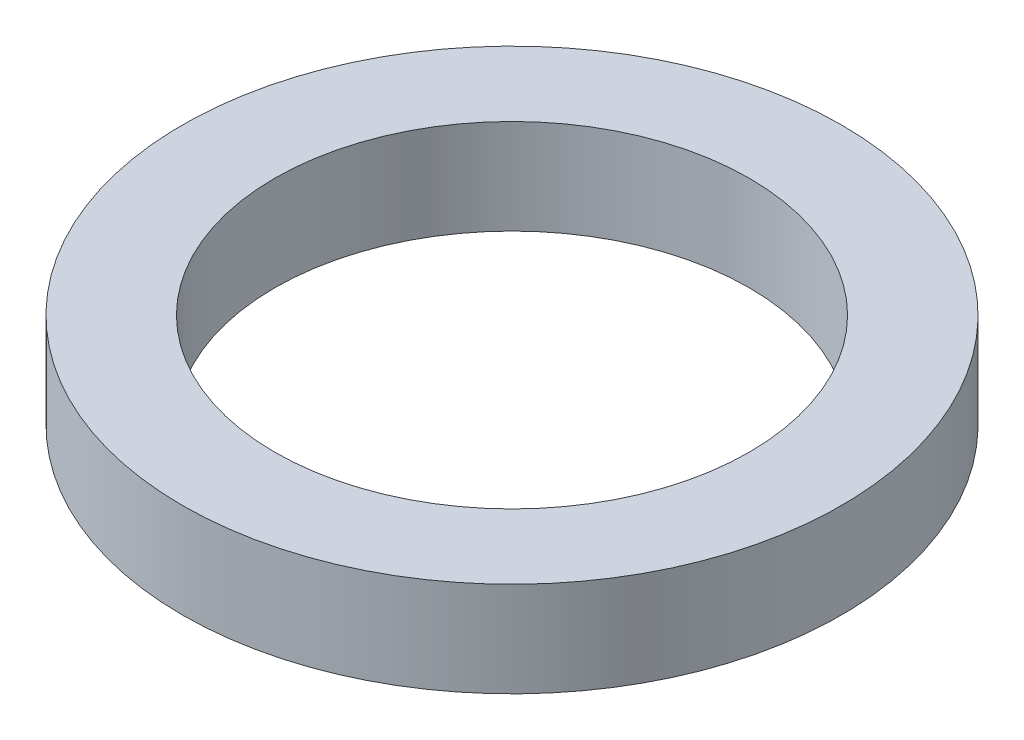
ISO-10303-21;
HEADER;
FILE_DESCRIPTION(('STEP AP214'),'2;1');
FILE_NAME('part.step','',(''),(''),'','','');
FILE_SCHEMA(('AUTOMOTIVE_DESIGN { 1 0 10303 214 1 1 1 1 }'));
ENDSEC;
DATA;
#1=APPLICATION_CONTEXT('core data for automotive mechanical design processes');
#2=APPLICATION_PROTOCOL_DEFINITION('international standard','automotive_design',2000,#1);
#3=PRODUCT_CONTEXT('',#1,'mechanical');
#4=PRODUCT('Part','Part','',(#3));
#5=PRODUCT_RELATED_PRODUCT_CATEGORY('part','',(#4));
#6=PRODUCT_DEFINITION_FORMATION('','',#4);
#7=PRODUCT_DEFINITION_CONTEXT('part definition',#1,'design');
#8=PRODUCT_DEFINITION('design','',#6,#7);
#9=PRODUCT_DEFINITION_SHAPE('','',#8);
#10=(LENGTH_UNIT() NAMED_UNIT(*) SI_UNIT(.MILLI.,.METRE.));
#11=(NAMED_UNIT(*) PLANE_ANGLE_UNIT() SI_UNIT($,.RADIAN.));
#12=(NAMED_UNIT(*) SI_UNIT($,.STERADIAN.) SOLID_ANGLE_UNIT());
#13=UNCERTAINTY_MEASURE_WITH_UNIT(LENGTH_MEASURE(1.E-05),#10,'distance_accuracy_value','');
#14=(GEOMETRIC_REPRESENTATION_CONTEXT(3) GLOBAL_UNCERTAINTY_ASSIGNED_CONTEXT((#13)) GLOBAL_UNIT_ASSIGNED_CONTEXT((#10,
#11,#12)) REPRESENTATION_CONTEXT('',''));
#15=CARTESIAN_POINT('',(0.,0.,0.));
#16=DIRECTION('',(0.,0.,1.));
#17=DIRECTION('',(1.,0.,0.));
#18=AXIS2_PLACEMENT_3D('',#15,#16,#17);
#19=CARTESIAN_POINT('',(0.,18.,0.));
#20=DIRECTION('',(0.,-1.,0.));
#21=DIRECTION('',(0.,0.,-1.));
#22=AXIS2_PLACEMENT_3D('',#19,#20,#21);
#23=CYLINDRICAL_SURFACE('',#22,62.5);
#24=CARTESIAN_POINT('',(0.,18.,0.));
#25=DIRECTION('',(0.,1.,0.));
#26=DIRECTION('',(0.,0.,1.));
#27=AXIS2_PLACEMENT_3D('',#24,#25,#26);
#28=CIRCLE('',#27,62.5);
#29=CARTESIAN_POINT('',(0.,18.,62.5));
#30=VERTEX_POINT('',#29);
#31=EDGE_CURVE('E10',#30,#30,#28,.T.);
#32=ORIENTED_EDGE('',*,*,#31,.F.);
#33=EDGE_LOOP('',(#32));
#34=FACE_BOUND('',#33,.T.);
#35=CARTESIAN_POINT('',(0.,0.,0.));
#36=DIRECTION('',(0.,1.,0.));
#37=DIRECTION('',(0.,0.,1.));
#38=AXIS2_PLACEMENT_3D('',#35,#36,#37);
#39=CIRCLE('',#38,62.5);
#40=CARTESIAN_POINT('',(0.,0.,62.5));
#41=VERTEX_POINT('',#40);
#42=EDGE_CURVE('E37',#41,#41,#39,.T.);
#43=ORIENTED_EDGE('',*,*,#42,.T.);
#44=EDGE_LOOP('',(#43));
#45=FACE_BOUND('',#44,.T.);
#46=ADVANCED_FACE('F40',(#34,#45),#23,.T.);
#47=CARTESIAN_POINT('',(0.,18.,0.));
#48=DIRECTION('',(0.,1.,0.));
#49=DIRECTION('',(0.,0.,1.));
#50=AXIS2_PLACEMENT_3D('',#47,#48,#49);
#51=PLANE('',#50);
#52=CARTESIAN_POINT('',(0.,18.,0.));
#53=DIRECTION('',(0.,1.,0.));
#54=DIRECTION('',(0.,0.,1.));
#55=AXIS2_PLACEMENT_3D('',#52,#53,#54);
#56=CIRCLE('',#55,45.);
#57=CARTESIAN_POINT('',(0.,18.,45.));
#58=VERTEX_POINT('',#57);
#59=EDGE_CURVE('E50',#58,#58,#56,.T.);
#60=ORIENTED_EDGE('',*,*,#59,.F.);
#61=EDGE_LOOP('',(#60));
#62=FACE_BOUND('',#61,.T.);
#63=ORIENTED_EDGE('',*,*,#31,.T.);
#64=EDGE_LOOP('',(#63));
#65=FACE_BOUND('',#64,.T.);
#66=ADVANCED_FACE('F59',(#62,#65),#51,.T.);
#67=CARTESIAN_POINT('',(0.,0.,0.));
#68=DIRECTION('',(0.,1.,0.));
#69=DIRECTION('',(0.,0.,1.));
#70=AXIS2_PLACEMENT_3D('',#67,#68,#69);
#71=PLANE('',#70);
#72=CARTESIAN_POINT('',(0.,0.,0.));
#73=DIRECTION('',(0.,1.,0.));
#74=DIRECTION('',(0.,0.,1.));
#75=AXIS2_PLACEMENT_3D('',#72,#73,#74);
#76=CIRCLE('',#75,45.);
#77=CARTESIAN_POINT('',(0.,0.,45.));
#78=VERTEX_POINT('',#77);
#79=EDGE_CURVE('E47',#78,#78,#76,.T.);
#80=ORIENTED_EDGE('',*,*,#79,.T.);
#81=EDGE_LOOP('',(#80));
#82=FACE_BOUND('',#81,.T.);
#83=ORIENTED_EDGE('',*,*,#42,.F.);
#84=EDGE_LOOP('',(#83));
#85=FACE_BOUND('',#84,.T.);
#86=ADVANCED_FACE('F58',(#82,#85),#71,.F.);
#87=CARTESIAN_POINT('',(0.,18.,0.));
#88=DIRECTION('',(0.,-1.,0.));
#89=DIRECTION('',(0.,0.,-1.));
#90=AXIS2_PLACEMENT_3D('',#87,#88,#89);
#91=CYLINDRICAL_SURFACE('',#90,45.);
#92=ORIENTED_EDGE('',*,*,#59,.T.);
#93=EDGE_LOOP('',(#92));
#94=FACE_BOUND('',#93,.T.);
#95=ORIENTED_EDGE('',*,*,#79,.F.);
#96=EDGE_LOOP('',(#95));
#97=FACE_BOUND('',#96,.T.);
#98=ADVANCED_FACE('F54',(#94,#97),#91,.F.);
#99=CLOSED_SHELL('',(#46,#66,#86,#98));
#100=MANIFOLD_SOLID_BREP('B2',#99);
#101=ADVANCED_BREP_SHAPE_REPRESENTATION('',(#18,#100),#14);
#102=SHAPE_DEFINITION_REPRESENTATION(#9,#101);
ENDSEC;
END-ISO-10303-21;
